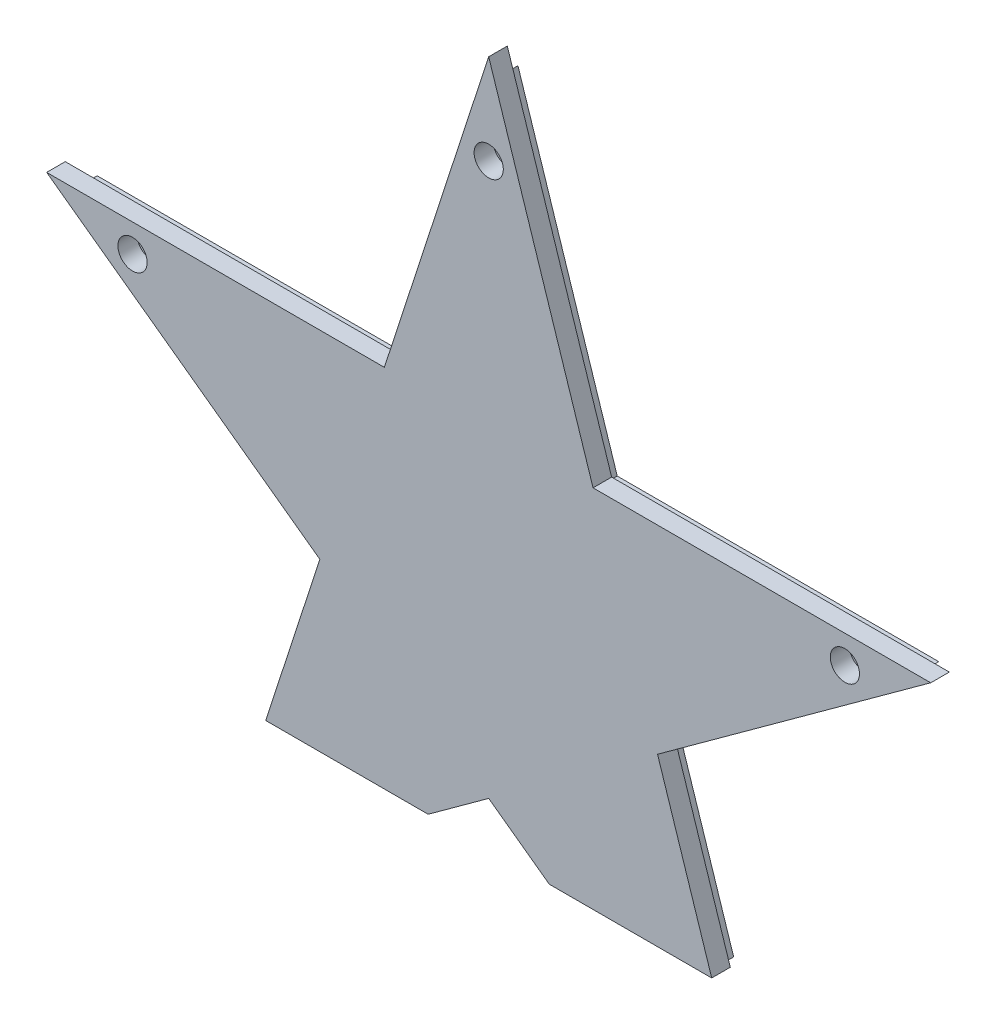
ISO-10303-21;
HEADER;
FILE_DESCRIPTION(('STEP AP214'),'2;1');
FILE_NAME('part.step','',(''),(''),'','','');
FILE_SCHEMA(('AUTOMOTIVE_DESIGN { 1 0 10303 214 1 1 1 1 }'));
ENDSEC;
DATA;
#1=APPLICATION_CONTEXT('core data for automotive mechanical design processes');
#2=APPLICATION_PROTOCOL_DEFINITION('international standard','automotive_design',2000,#1);
#3=PRODUCT_CONTEXT('',#1,'mechanical');
#4=PRODUCT('Part','Part','',(#3));
#5=PRODUCT_RELATED_PRODUCT_CATEGORY('part','',(#4));
#6=PRODUCT_DEFINITION_FORMATION('','',#4);
#7=PRODUCT_DEFINITION_CONTEXT('part definition',#1,'design');
#8=PRODUCT_DEFINITION('design','',#6,#7);
#9=PRODUCT_DEFINITION_SHAPE('','',#8);
#10=(LENGTH_UNIT() NAMED_UNIT(*) SI_UNIT(.MILLI.,.METRE.));
#11=(NAMED_UNIT(*) PLANE_ANGLE_UNIT() SI_UNIT($,.RADIAN.));
#12=(NAMED_UNIT(*) SI_UNIT($,.STERADIAN.) SOLID_ANGLE_UNIT());
#13=UNCERTAINTY_MEASURE_WITH_UNIT(LENGTH_MEASURE(1.E-05),#10,'distance_accuracy_value','');
#14=(GEOMETRIC_REPRESENTATION_CONTEXT(3) GLOBAL_UNCERTAINTY_ASSIGNED_CONTEXT((#13)) GLOBAL_UNIT_ASSIGNED_CONTEXT((#10,
#11,#12)) REPRESENTATION_CONTEXT('',''));
#15=CARTESIAN_POINT('',(0.,0.,0.));
#16=DIRECTION('',(0.,0.,1.));
#17=DIRECTION('',(1.,0.,0.));
#18=AXIS2_PLACEMENT_3D('',#15,#16,#17);
#19=CARTESIAN_POINT('',(-67.0494843988083,21.7856981034338,-4.5));
#20=DIRECTION('',(0.,0.,1.));
#21=DIRECTION('',(1.,0.,0.));
#22=AXIS2_PLACEMENT_3D('',#19,#20,#21);
#23=CYLINDRICAL_SURFACE('',#22,1.85);
#24=CARTESIAN_POINT('',(-67.0494843988083,21.7856981034338,0.));
#25=DIRECTION('',(0.,0.,1.));
#26=DIRECTION('',(1.,0.,0.));
#27=AXIS2_PLACEMENT_3D('',#24,#25,#26);
#28=CIRCLE('',#27,1.85);
#29=CARTESIAN_POINT('',(-65.1994843988083,21.7856981034338,0.));
#30=VERTEX_POINT('',#29);
#31=EDGE_CURVE('E226',#30,#30,#28,.T.);
#32=ORIENTED_EDGE('',*,*,#31,.F.);
#33=EDGE_LOOP('',(#32));
#34=FACE_BOUND('',#33,.T.);
#35=CARTESIAN_POINT('',(-67.0494843988083,21.7856981034338,1.9));
#36=DIRECTION('',(0.,0.,1.));
#37=DIRECTION('',(1.,0.,0.));
#38=AXIS2_PLACEMENT_3D('',#35,#36,#37);
#39=CIRCLE('',#38,1.85);
#40=CARTESIAN_POINT('',(-65.1994843988083,21.7856981034338,1.9));
#41=VERTEX_POINT('',#40);
#42=EDGE_CURVE('E41',#41,#41,#39,.F.);
#43=ORIENTED_EDGE('',*,*,#42,.F.);
#44=EDGE_LOOP('',(#43));
#45=FACE_BOUND('',#44,.T.);
#46=ADVANCED_FACE('F37',(#34,#45),#23,.F.);
#47=CARTESIAN_POINT('',(67.0494843988083,21.7856981034338,-4.5));
#48=DIRECTION('',(0.,0.,1.));
#49=DIRECTION('',(1.,0.,0.));
#50=AXIS2_PLACEMENT_3D('',#47,#48,#49);
#51=CYLINDRICAL_SURFACE('',#50,1.85);
#52=CARTESIAN_POINT('',(67.0494843988083,21.7856981034338,0.));
#53=DIRECTION('',(0.,0.,1.));
#54=DIRECTION('',(1.,0.,0.));
#55=AXIS2_PLACEMENT_3D('',#52,#53,#54);
#56=CIRCLE('',#55,1.85);
#57=CARTESIAN_POINT('',(68.8994843988083,21.7856981034338,0.));
#58=VERTEX_POINT('',#57);
#59=EDGE_CURVE('E230',#58,#58,#56,.T.);
#60=ORIENTED_EDGE('',*,*,#59,.F.);
#61=EDGE_LOOP('',(#60));
#62=FACE_BOUND('',#61,.T.);
#63=CARTESIAN_POINT('',(67.0494843988083,21.7856981034338,1.9));
#64=DIRECTION('',(0.,0.,1.));
#65=DIRECTION('',(1.,0.,0.));
#66=AXIS2_PLACEMENT_3D('',#63,#64,#65);
#67=CIRCLE('',#66,1.85);
#68=CARTESIAN_POINT('',(68.8994843988083,21.7856981034338,1.9));
#69=VERTEX_POINT('',#68);
#70=EDGE_CURVE('E220',#69,#69,#67,.F.);
#71=ORIENTED_EDGE('',*,*,#70,.F.);
#72=EDGE_LOOP('',(#71));
#73=FACE_BOUND('',#72,.T.);
#74=ADVANCED_FACE('F472',(#62,#73),#51,.F.);
#75=CARTESIAN_POINT('',(0.,70.5,-4.5));
#76=DIRECTION('',(0.,0.,1.));
#77=DIRECTION('',(1.,0.,0.));
#78=AXIS2_PLACEMENT_3D('',#75,#76,#77);
#79=CYLINDRICAL_SURFACE('',#78,1.85);
#80=CARTESIAN_POINT('',(0.,70.5,0.));
#81=DIRECTION('',(0.,0.,1.));
#82=DIRECTION('',(1.,0.,0.));
#83=AXIS2_PLACEMENT_3D('',#80,#81,#82);
#84=CIRCLE('',#83,1.85);
#85=CARTESIAN_POINT('',(1.85,70.5,0.));
#86=VERTEX_POINT('',#85);
#87=EDGE_CURVE('E235',#86,#86,#84,.T.);
#88=ORIENTED_EDGE('',*,*,#87,.F.);
#89=EDGE_LOOP('',(#88));
#90=FACE_BOUND('',#89,.T.);
#91=CARTESIAN_POINT('',(0.,70.5,1.9));
#92=DIRECTION('',(0.,0.,1.));
#93=DIRECTION('',(1.,0.,0.));
#94=AXIS2_PLACEMENT_3D('',#91,#92,#93);
#95=CIRCLE('',#94,1.85);
#96=CARTESIAN_POINT('',(1.85,70.5,1.9));
#97=VERTEX_POINT('',#96);
#98=EDGE_CURVE('E218',#97,#97,#95,.F.);
#99=ORIENTED_EDGE('',*,*,#98,.F.);
#100=EDGE_LOOP('',(#99));
#101=FACE_BOUND('',#100,.T.);
#102=ADVANCED_FACE('F478',(#90,#101),#79,.F.);
#103=CARTESIAN_POINT('',(30.2579939442741,-9.83141820099068,2.));
#104=DIRECTION('',(-0.587785252292473,0.809016994374948,0.));
#105=DIRECTION('',(-0.809016994374948,-0.587785252292473,0.));
#106=AXIS2_PLACEMENT_3D('',#103,#104,#105);
#107=PLANE('',#106);
#108=DIRECTION('',(0.809016994374948,0.587785252292473,0.));
#109=VECTOR('',#108,1.);
#110=CARTESIAN_POINT('',(30.2579939442741,-9.83141820099068,0.));
#111=LINE('',#110,#109);
#112=CARTESIAN_POINT('',(30.2579939442741,-9.83141820099068,0.));
#113=VERTEX_POINT('',#112);
#114=CARTESIAN_POINT('',(79.2164565774981,25.7389870078079,0.));
#115=VERTEX_POINT('',#114);
#116=EDGE_CURVE('E173',#113,#115,#111,.T.);
#117=ORIENTED_EDGE('',*,*,#116,.T.);
#118=DIRECTION('',(0.,0.,-1.));
#119=VECTOR('',#118,1.);
#120=CARTESIAN_POINT('',(79.2164565774981,25.7389870078079,2.));
#121=LINE('',#120,#119);
#122=CARTESIAN_POINT('',(79.2164565774981,25.7389870078079,2.));
#123=VERTEX_POINT('',#122);
#124=EDGE_CURVE('E11',#123,#115,#121,.T.);
#125=ORIENTED_EDGE('',*,*,#124,.F.);
#126=DIRECTION('',(0.809016994374948,0.587785252292473,0.));
#127=VECTOR('',#126,1.);
#128=CARTESIAN_POINT('',(30.2579939442741,-9.83141820099068,2.));
#129=LINE('',#128,#127);
#130=CARTESIAN_POINT('',(30.2579939442741,-9.83141820099068,2.));
#131=VERTEX_POINT('',#130);
#132=EDGE_CURVE('E196',#131,#123,#129,.T.);
#133=ORIENTED_EDGE('',*,*,#132,.F.);
#134=DIRECTION('',(0.,0.,-1.));
#135=VECTOR('',#134,1.);
#136=CARTESIAN_POINT('',(30.2579939442741,-9.83141820099068,2.));
#137=LINE('',#136,#135);
#138=EDGE_CURVE('E172',#131,#113,#137,.T.);
#139=ORIENTED_EDGE('',*,*,#138,.T.);
#140=EDGE_LOOP('',(#117,#125,#133,#139));
#141=FACE_BOUND('',#140,.T.);
#142=ADVANCED_FACE('F39',(#141),#107,.F.);
#143=CARTESIAN_POINT('',(79.2164565774981,25.7389870078079,2.));
#144=DIRECTION('',(0.,-1.,0.));
#145=DIRECTION('',(0.,0.,-1.));
#146=AXIS2_PLACEMENT_3D('',#143,#144,#145);
#147=PLANE('',#146);
#148=DIRECTION('',(-1.,0.,0.));
#149=VECTOR('',#148,1.);
#150=CARTESIAN_POINT('',(79.2164565774981,25.7389870078079,0.));
#151=LINE('',#150,#149);
#152=CARTESIAN_POINT('',(18.70046868895,25.7389870078079,0.));
#153=VERTEX_POINT('',#152);
#154=EDGE_CURVE('E176',#115,#153,#151,.T.);
#155=ORIENTED_EDGE('',*,*,#154,.T.);
#156=DIRECTION('',(0.,0.,-1.));
#157=VECTOR('',#156,1.);
#158=CARTESIAN_POINT('',(18.70046868895,25.7389870078079,2.));
#159=LINE('',#158,#157);
#160=CARTESIAN_POINT('',(18.70046868895,25.7389870078079,2.));
#161=VERTEX_POINT('',#160);
#162=EDGE_CURVE('E47',#161,#153,#159,.T.);
#163=ORIENTED_EDGE('',*,*,#162,.F.);
#164=DIRECTION('',(-1.,0.,0.));
#165=VECTOR('',#164,1.);
#166=CARTESIAN_POINT('',(79.2164565774981,25.7389870078079,2.));
#167=LINE('',#166,#165);
#168=EDGE_CURVE('E110',#123,#161,#167,.T.);
#169=ORIENTED_EDGE('',*,*,#168,.F.);
#170=ORIENTED_EDGE('',*,*,#124,.T.);
#171=EDGE_LOOP('',(#155,#163,#169,#170));
#172=FACE_BOUND('',#171,.T.);
#173=ADVANCED_FACE('F521',(#172),#147,.F.);
#174=CARTESIAN_POINT('',(18.70046868895,25.7389870078079,2.));
#175=DIRECTION('',(-0.951056516295153,-0.309016994374949,0.));
#176=DIRECTION('',(0.309016994374949,-0.951056516295153,0.));
#177=AXIS2_PLACEMENT_3D('',#174,#175,#176);
#178=PLANE('',#177);
#179=DIRECTION('',(-0.309016994374949,0.951056516295153,0.));
#180=VECTOR('',#179,1.);
#181=CARTESIAN_POINT('',(18.70046868895,25.7389870078079,0.));
#182=LINE('',#181,#180);
#183=CARTESIAN_POINT('',(0.,83.2931116292503,0.));
#184=VERTEX_POINT('',#183);
#185=EDGE_CURVE('E179',#153,#184,#182,.T.);
#186=ORIENTED_EDGE('',*,*,#185,.T.);
#187=DIRECTION('',(0.,0.,-1.));
#188=VECTOR('',#187,1.);
#189=CARTESIAN_POINT('',(0.,83.2931116292503,2.));
#190=LINE('',#189,#188);
#191=CARTESIAN_POINT('',(0.,83.2931116292503,2.));
#192=VERTEX_POINT('',#191);
#193=EDGE_CURVE('E213',#192,#184,#190,.T.);
#194=ORIENTED_EDGE('',*,*,#193,.F.);
#195=DIRECTION('',(-0.309016994374949,0.951056516295153,0.));
#196=VECTOR('',#195,1.);
#197=CARTESIAN_POINT('',(18.70046868895,25.7389870078079,2.));
#198=LINE('',#197,#196);
#199=EDGE_CURVE('E353',#161,#192,#198,.T.);
#200=ORIENTED_EDGE('',*,*,#199,.F.);
#201=ORIENTED_EDGE('',*,*,#162,.T.);
#202=EDGE_LOOP('',(#186,#194,#200,#201));
#203=FACE_BOUND('',#202,.T.);
#204=ADVANCED_FACE('F518',(#203),#178,.F.);
#205=CARTESIAN_POINT('',(0.,83.2931116292503,2.));
#206=DIRECTION('',(0.951056516295154,-0.309016994374947,0.));
#207=DIRECTION('',(0.309016994374947,0.951056516295154,0.));
#208=AXIS2_PLACEMENT_3D('',#205,#206,#207);
#209=PLANE('',#208);
#210=DIRECTION('',(-0.309016994374947,-0.951056516295154,0.));
#211=VECTOR('',#210,1.);
#212=CARTESIAN_POINT('',(0.,83.2931116292503,0.));
#213=LINE('',#212,#211);
#214=CARTESIAN_POINT('',(-18.7004686889499,25.7389870078079,0.));
#215=VERTEX_POINT('',#214);
#216=EDGE_CURVE('E181',#184,#215,#213,.T.);
#217=ORIENTED_EDGE('',*,*,#216,.T.);
#218=DIRECTION('',(0.,0.,-1.));
#219=VECTOR('',#218,1.);
#220=CARTESIAN_POINT('',(-18.7004686889499,25.7389870078079,2.));
#221=LINE('',#220,#219);
#222=CARTESIAN_POINT('',(-18.7004686889499,25.7389870078079,2.));
#223=VERTEX_POINT('',#222);
#224=EDGE_CURVE('E210',#223,#215,#221,.T.);
#225=ORIENTED_EDGE('',*,*,#224,.F.);
#226=DIRECTION('',(-0.309016994374947,-0.951056516295154,0.));
#227=VECTOR('',#226,1.);
#228=CARTESIAN_POINT('',(0.,83.2931116292503,2.));
#229=LINE('',#228,#227);
#230=EDGE_CURVE('E356',#192,#223,#229,.T.);
#231=ORIENTED_EDGE('',*,*,#230,.F.);
#232=ORIENTED_EDGE('',*,*,#193,.T.);
#233=EDGE_LOOP('',(#217,#225,#231,#232));
#234=FACE_BOUND('',#233,.T.);
#235=ADVANCED_FACE('F514',(#234),#209,.F.);
#236=CARTESIAN_POINT('',(-18.7004686889499,25.7389870078079,2.));
#237=DIRECTION('',(0.,-1.,0.));
#238=DIRECTION('',(0.,0.,-1.));
#239=AXIS2_PLACEMENT_3D('',#236,#237,#238);
#240=PLANE('',#239);
#241=DIRECTION('',(-1.,0.,0.));
#242=VECTOR('',#241,1.);
#243=CARTESIAN_POINT('',(-18.7004686889499,25.7389870078079,0.));
#244=LINE('',#243,#242);
#245=CARTESIAN_POINT('',(-79.2164565774982,25.7389870078079,0.));
#246=VERTEX_POINT('',#245);
#247=EDGE_CURVE('E183',#215,#246,#244,.T.);
#248=ORIENTED_EDGE('',*,*,#247,.T.);
#249=DIRECTION('',(0.,0.,-1.));
#250=VECTOR('',#249,1.);
#251=CARTESIAN_POINT('',(-79.2164565774982,25.7389870078079,2.));
#252=LINE('',#251,#250);
#253=CARTESIAN_POINT('',(-79.2164565774982,25.7389870078079,2.));
#254=VERTEX_POINT('',#253);
#255=EDGE_CURVE('E207',#254,#246,#252,.T.);
#256=ORIENTED_EDGE('',*,*,#255,.F.);
#257=DIRECTION('',(-1.,0.,0.));
#258=VECTOR('',#257,1.);
#259=CARTESIAN_POINT('',(-18.7004686889499,25.7389870078079,2.));
#260=LINE('',#259,#258);
#261=EDGE_CURVE('E359',#223,#254,#260,.T.);
#262=ORIENTED_EDGE('',*,*,#261,.F.);
#263=ORIENTED_EDGE('',*,*,#224,.T.);
#264=EDGE_LOOP('',(#248,#256,#262,#263));
#265=FACE_BOUND('',#264,.T.);
#266=ADVANCED_FACE('F511',(#265),#240,.F.);
#267=CARTESIAN_POINT('',(-79.2164565774982,25.7389870078079,2.));
#268=DIRECTION('',(0.587785252292473,0.809016994374948,0.));
#269=DIRECTION('',(-0.809016994374948,0.587785252292473,0.));
#270=AXIS2_PLACEMENT_3D('',#267,#268,#269);
#271=PLANE('',#270);
#272=DIRECTION('',(0.809016994374948,-0.587785252292473,0.));
#273=VECTOR('',#272,1.);
#274=CARTESIAN_POINT('',(-79.2164565774982,25.7389870078079,0.));
#275=LINE('',#274,#273);
#276=CARTESIAN_POINT('',(-30.2579939442741,-9.83141820099067,0.));
#277=VERTEX_POINT('',#276);
#278=EDGE_CURVE('E185',#246,#277,#275,.T.);
#279=ORIENTED_EDGE('',*,*,#278,.T.);
#280=DIRECTION('',(0.,0.,-1.));
#281=VECTOR('',#280,1.);
#282=CARTESIAN_POINT('',(-30.2579939442741,-9.83141820099067,2.));
#283=LINE('',#282,#281);
#284=CARTESIAN_POINT('',(-30.2579939442741,-9.83141820099067,2.));
#285=VERTEX_POINT('',#284);
#286=EDGE_CURVE('E204',#285,#277,#283,.T.);
#287=ORIENTED_EDGE('',*,*,#286,.F.);
#288=DIRECTION('',(0.809016994374948,-0.587785252292473,0.));
#289=VECTOR('',#288,1.);
#290=CARTESIAN_POINT('',(-79.2164565774982,25.7389870078079,2.));
#291=LINE('',#290,#289);
#292=EDGE_CURVE('E166',#254,#285,#291,.T.);
#293=ORIENTED_EDGE('',*,*,#292,.F.);
#294=ORIENTED_EDGE('',*,*,#255,.T.);
#295=EDGE_LOOP('',(#279,#287,#293,#294));
#296=FACE_BOUND('',#295,.T.);
#297=ADVANCED_FACE('F369',(#296),#271,.F.);
#298=CARTESIAN_POINT('',(-30.2579939442741,-9.83141820099067,2.));
#299=DIRECTION('',(0.951056516295154,-0.309016994374947,0.));
#300=DIRECTION('',(0.309016994374947,0.951056516295154,0.));
#301=AXIS2_PLACEMENT_3D('',#298,#299,#300);
#302=PLANE('',#301);
#303=DIRECTION('',(-0.309016994374947,-0.951056516295154,0.));
#304=VECTOR('',#303,1.);
#305=CARTESIAN_POINT('',(-30.2579939442741,-9.83141820099067,0.));
#306=LINE('',#305,#304);
#307=CARTESIAN_POINT('',(-40.6150037851004,-41.7070168824639,0.));
#308=VERTEX_POINT('',#307);
#309=EDGE_CURVE('E187',#277,#308,#306,.T.);
#310=ORIENTED_EDGE('',*,*,#309,.T.);
#311=DIRECTION('',(0.,0.,-1.));
#312=VECTOR('',#311,1.);
#313=CARTESIAN_POINT('',(-40.6150037851004,-41.7070168824639,2.));
#314=LINE('',#313,#312);
#315=CARTESIAN_POINT('',(-40.6150037851004,-41.7070168824639,2.));
#316=VERTEX_POINT('',#315);
#317=EDGE_CURVE('E201',#316,#308,#314,.T.);
#318=ORIENTED_EDGE('',*,*,#317,.F.);
#319=DIRECTION('',(-0.309016994374947,-0.951056516295154,0.));
#320=VECTOR('',#319,1.);
#321=CARTESIAN_POINT('',(-30.2579939442741,-9.83141820099067,2.));
#322=LINE('',#321,#320);
#323=EDGE_CURVE('E163',#285,#316,#322,.T.);
#324=ORIENTED_EDGE('',*,*,#323,.F.);
#325=ORIENTED_EDGE('',*,*,#286,.T.);
#326=EDGE_LOOP('',(#310,#318,#324,#325));
#327=FACE_BOUND('',#326,.T.);
#328=ADVANCED_FACE('F373',(#327),#302,.F.);
#329=CARTESIAN_POINT('',(-40.6150037851004,-41.7070168824639,2.));
#330=DIRECTION('',(0.,1.,0.));
#331=DIRECTION('',(-1.,0.,0.));
#332=AXIS2_PLACEMENT_3D('',#329,#330,#331);
#333=PLANE('',#332);
#334=DIRECTION('',(1.,0.,0.));
#335=VECTOR('',#334,1.);
#336=CARTESIAN_POINT('',(-40.6150037851004,-41.7070168824639,0.));
#337=LINE('',#336,#335);
#338=CARTESIAN_POINT('',(-13.6150037851004,-41.7070168824639,0.));
#339=VERTEX_POINT('',#338);
#340=EDGE_CURVE('E189',#308,#339,#337,.T.);
#341=ORIENTED_EDGE('',*,*,#340,.T.);
#342=DIRECTION('',(0.,0.,-1.));
#343=VECTOR('',#342,1.);
#344=CARTESIAN_POINT('',(-13.6150037851004,-41.7070168824639,2.));
#345=LINE('',#344,#343);
#346=CARTESIAN_POINT('',(-13.6150037851004,-41.7070168824639,2.));
#347=VERTEX_POINT('',#346);
#348=EDGE_CURVE('E148',#347,#339,#345,.T.);
#349=ORIENTED_EDGE('',*,*,#348,.F.);
#350=DIRECTION('',(1.,0.,0.));
#351=VECTOR('',#350,1.);
#352=CARTESIAN_POINT('',(-41.9819046766102,-41.7070168824639,2.));
#353=LINE('',#352,#351);
#354=CARTESIAN_POINT('',(-11.4033116833851,-41.7070168824639,2.));
#355=VERTEX_POINT('',#354);
#356=EDGE_CURVE('E162',#347,#355,#353,.T.);
#357=ORIENTED_EDGE('',*,*,#356,.T.);
#358=DIRECTION('',(0.,0.,-1.));
#359=VECTOR('',#358,1.);
#360=CARTESIAN_POINT('',(-11.4033116833851,-41.7070168824639,5.5));
#361=LINE('',#360,#359);
#362=CARTESIAN_POINT('',(-11.4033116833851,-41.7070168824639,5.5));
#363=VERTEX_POINT('',#362);
#364=EDGE_CURVE('E345',#363,#355,#361,.T.);
#365=ORIENTED_EDGE('',*,*,#364,.F.);
#366=DIRECTION('',(1.,0.,0.));
#367=VECTOR('',#366,1.);
#368=CARTESIAN_POINT('',(-41.9819046766102,-41.7070168824639,5.5));
#369=LINE('',#368,#367);
#370=CARTESIAN_POINT('',(-41.9819046766102,-41.7070168824639,5.5));
#371=VERTEX_POINT('',#370);
#372=EDGE_CURVE('E247',#371,#363,#369,.T.);
#373=ORIENTED_EDGE('',*,*,#372,.F.);
#374=DIRECTION('',(0.,0.,-1.));
#375=VECTOR('',#374,1.);
#376=CARTESIAN_POINT('',(-41.9819046766102,-41.7070168824639,5.5));
#377=LINE('',#376,#375);
#378=CARTESIAN_POINT('',(-41.9819046766102,-41.7070168824639,2.));
#379=VERTEX_POINT('',#378);
#380=EDGE_CURVE('E177',#371,#379,#377,.T.);
#381=ORIENTED_EDGE('',*,*,#380,.T.);
#382=EDGE_CURVE('E284',#379,#316,#353,.T.);
#383=ORIENTED_EDGE('',*,*,#382,.T.);
#384=ORIENTED_EDGE('',*,*,#317,.T.);
#385=EDGE_LOOP('',(#341,#349,#357,#365,#373,#381,#383,#384));
#386=FACE_BOUND('',#385,.T.);
#387=ADVANCED_FACE('F376',(#386),#333,.F.);
#388=CARTESIAN_POINT('',(-13.6150037851004,-41.7070168824639,2.));
#389=DIRECTION('',(-0.587785252292473,0.809016994374947,0.));
#390=DIRECTION('',(-0.809016994374948,-0.587785252292473,0.));
#391=AXIS2_PLACEMENT_3D('',#388,#389,#390);
#392=PLANE('',#391);
#393=DIRECTION('',(0.809016994374947,0.587785252292473,0.));
#394=VECTOR('',#393,1.);
#395=CARTESIAN_POINT('',(-13.6150037851004,-41.7070168824639,0.));
#396=LINE('',#395,#394);
#397=CARTESIAN_POINT('',(0.,-31.8151376136345,0.));
#398=VERTEX_POINT('',#397);
#399=EDGE_CURVE('E145',#339,#398,#396,.T.);
#400=ORIENTED_EDGE('',*,*,#399,.T.);
#401=DIRECTION('',(0.,0.,-1.));
#402=VECTOR('',#401,1.);
#403=CARTESIAN_POINT('',(0.,-31.8151376136345,2.));
#404=LINE('',#403,#402);
#405=CARTESIAN_POINT('',(0.,-31.8151376136345,2.));
#406=VERTEX_POINT('',#405);
#407=EDGE_CURVE('E137',#406,#398,#404,.T.);
#408=ORIENTED_EDGE('',*,*,#407,.F.);
#409=DIRECTION('',(0.809016994374947,0.587785252292473,0.));
#410=VECTOR('',#409,1.);
#411=CARTESIAN_POINT('',(-13.6150037851004,-41.7070168824639,2.));
#412=LINE('',#411,#410);
#413=EDGE_CURVE('E142',#347,#406,#412,.T.);
#414=ORIENTED_EDGE('',*,*,#413,.F.);
#415=ORIENTED_EDGE('',*,*,#348,.T.);
#416=EDGE_LOOP('',(#400,#408,#414,#415));
#417=FACE_BOUND('',#416,.T.);
#418=ADVANCED_FACE('F139',(#417),#392,.F.);
#419=CARTESIAN_POINT('',(0.,-31.8151376136345,2.));
#420=DIRECTION('',(0.587785252292473,0.809016994374947,0.));
#421=DIRECTION('',(-0.809016994374947,0.587785252292473,0.));
#422=AXIS2_PLACEMENT_3D('',#419,#420,#421);
#423=PLANE('',#422);
#424=DIRECTION('',(0.809016994374947,-0.587785252292473,0.));
#425=VECTOR('',#424,1.);
#426=CARTESIAN_POINT('',(0.,-31.8151376136345,0.));
#427=LINE('',#426,#425);
#428=CARTESIAN_POINT('',(13.6150037851004,-41.7070168824639,0.));
#429=VERTEX_POINT('',#428);
#430=EDGE_CURVE('E192',#398,#429,#427,.T.);
#431=ORIENTED_EDGE('',*,*,#430,.T.);
#432=DIRECTION('',(0.,0.,-1.));
#433=VECTOR('',#432,1.);
#434=CARTESIAN_POINT('',(13.6150037851004,-41.7070168824639,2.));
#435=LINE('',#434,#433);
#436=CARTESIAN_POINT('',(13.6150037851004,-41.7070168824639,2.));
#437=VERTEX_POINT('',#436);
#438=EDGE_CURVE('E149',#437,#429,#435,.T.);
#439=ORIENTED_EDGE('',*,*,#438,.F.);
#440=DIRECTION('',(0.809016994374947,-0.587785252292473,0.));
#441=VECTOR('',#440,1.);
#442=CARTESIAN_POINT('',(0.,-31.8151376136345,2.));
#443=LINE('',#442,#441);
#444=EDGE_CURVE('E152',#406,#437,#443,.T.);
#445=ORIENTED_EDGE('',*,*,#444,.F.);
#446=ORIENTED_EDGE('',*,*,#407,.T.);
#447=EDGE_LOOP('',(#431,#439,#445,#446));
#448=FACE_BOUND('',#447,.T.);
#449=ADVANCED_FACE('F153',(#448),#423,.F.);
#450=CARTESIAN_POINT('',(13.6150037851004,-41.7070168824639,2.));
#451=DIRECTION('',(0.,1.,0.));
#452=DIRECTION('',(0.,0.,1.));
#453=AXIS2_PLACEMENT_3D('',#450,#451,#452);
#454=PLANE('',#453);
#455=DIRECTION('',(1.,0.,0.));
#456=VECTOR('',#455,1.);
#457=CARTESIAN_POINT('',(13.6150037851004,-41.7070168824639,0.));
#458=LINE('',#457,#456);
#459=CARTESIAN_POINT('',(40.6150037851004,-41.7070168824639,0.));
#460=VERTEX_POINT('',#459);
#461=EDGE_CURVE('E96',#429,#460,#458,.T.);
#462=ORIENTED_EDGE('',*,*,#461,.T.);
#463=DIRECTION('',(0.,0.,-1.));
#464=VECTOR('',#463,1.);
#465=CARTESIAN_POINT('',(40.6150037851004,-41.7070168824639,2.));
#466=LINE('',#465,#464);
#467=CARTESIAN_POINT('',(40.6150037851004,-41.7070168824639,2.));
#468=VERTEX_POINT('',#467);
#469=EDGE_CURVE('E56',#468,#460,#466,.T.);
#470=ORIENTED_EDGE('',*,*,#469,.F.);
#471=DIRECTION('',(1.,0.,0.));
#472=VECTOR('',#471,1.);
#473=CARTESIAN_POINT('',(11.4033116833851,-41.7070168824639,2.));
#474=LINE('',#473,#472);
#475=CARTESIAN_POINT('',(41.9819046766102,-41.7070168824639,2.));
#476=VERTEX_POINT('',#475);
#477=EDGE_CURVE('E293',#468,#476,#474,.T.);
#478=ORIENTED_EDGE('',*,*,#477,.T.);
#479=DIRECTION('',(0.,0.,-1.));
#480=VECTOR('',#479,1.);
#481=CARTESIAN_POINT('',(41.9819046766102,-41.7070168824639,5.5));
#482=LINE('',#481,#480);
#483=CARTESIAN_POINT('',(41.9819046766102,-41.7070168824639,5.5));
#484=VERTEX_POINT('',#483);
#485=EDGE_CURVE('E336',#484,#476,#482,.T.);
#486=ORIENTED_EDGE('',*,*,#485,.F.);
#487=DIRECTION('',(1.,0.,0.));
#488=VECTOR('',#487,1.);
#489=CARTESIAN_POINT('',(11.4033116833851,-41.7070168824639,5.5));
#490=LINE('',#489,#488);
#491=CARTESIAN_POINT('',(11.4033116833851,-41.7070168824639,5.5));
#492=VERTEX_POINT('',#491);
#493=EDGE_CURVE('E257',#492,#484,#490,.T.);
#494=ORIENTED_EDGE('',*,*,#493,.F.);
#495=DIRECTION('',(0.,0.,-1.));
#496=VECTOR('',#495,1.);
#497=CARTESIAN_POINT('',(11.4033116833851,-41.7070168824639,5.5));
#498=LINE('',#497,#496);
#499=CARTESIAN_POINT('',(11.4033116833851,-41.7070168824639,2.));
#500=VERTEX_POINT('',#499);
#501=EDGE_CURVE('E339',#492,#500,#498,.T.);
#502=ORIENTED_EDGE('',*,*,#501,.T.);
#503=EDGE_CURVE('E294',#500,#437,#474,.T.);
#504=ORIENTED_EDGE('',*,*,#503,.T.);
#505=ORIENTED_EDGE('',*,*,#438,.T.);
#506=EDGE_LOOP('',(#462,#470,#478,#486,#494,#502,#504,#505));
#507=FACE_BOUND('',#506,.T.);
#508=ADVANCED_FACE('F380',(#507),#454,.F.);
#509=CARTESIAN_POINT('',(40.6150037851004,-41.7070168824639,2.));
#510=DIRECTION('',(-0.951056516295154,-0.309016994374947,0.));
#511=DIRECTION('',(0.309016994374947,-0.951056516295154,0.));
#512=AXIS2_PLACEMENT_3D('',#509,#510,#511);
#513=PLANE('',#512);
#514=DIRECTION('',(-0.309016994374947,0.951056516295154,0.));
#515=VECTOR('',#514,1.);
#516=CARTESIAN_POINT('',(40.6150037851004,-41.7070168824639,0.));
#517=LINE('',#516,#515);
#518=EDGE_CURVE('E102',#460,#113,#517,.T.);
#519=ORIENTED_EDGE('',*,*,#518,.T.);
#520=ORIENTED_EDGE('',*,*,#138,.F.);
#521=DIRECTION('',(-0.309016994374947,0.951056516295154,0.));
#522=VECTOR('',#521,1.);
#523=CARTESIAN_POINT('',(40.6150037851004,-41.7070168824639,2.));
#524=LINE('',#523,#522);
#525=EDGE_CURVE('E157',#468,#131,#524,.T.);
#526=ORIENTED_EDGE('',*,*,#525,.F.);
#527=ORIENTED_EDGE('',*,*,#469,.T.);
#528=EDGE_LOOP('',(#519,#520,#526,#527));
#529=FACE_BOUND('',#528,.T.);
#530=ADVANCED_FACE('F488',(#529),#513,.F.);
#531=CARTESIAN_POINT('',(0.,0.,0.));
#532=DIRECTION('',(0.,0.,1.));
#533=DIRECTION('',(1.,0.,0.));
#534=AXIS2_PLACEMENT_3D('',#531,#532,#533);
#535=PLANE('',#534);
#536=ORIENTED_EDGE('',*,*,#87,.T.);
#537=EDGE_LOOP('',(#536));
#538=FACE_BOUND('',#537,.T.);
#539=ORIENTED_EDGE('',*,*,#59,.T.);
#540=EDGE_LOOP('',(#539));
#541=FACE_BOUND('',#540,.T.);
#542=ORIENTED_EDGE('',*,*,#31,.T.);
#543=EDGE_LOOP('',(#542));
#544=FACE_BOUND('',#543,.T.);
#545=ORIENTED_EDGE('',*,*,#116,.F.);
#546=ORIENTED_EDGE('',*,*,#518,.F.);
#547=ORIENTED_EDGE('',*,*,#461,.F.);
#548=ORIENTED_EDGE('',*,*,#430,.F.);
#549=ORIENTED_EDGE('',*,*,#399,.F.);
#550=ORIENTED_EDGE('',*,*,#340,.F.);
#551=ORIENTED_EDGE('',*,*,#309,.F.);
#552=ORIENTED_EDGE('',*,*,#278,.F.);
#553=ORIENTED_EDGE('',*,*,#247,.F.);
#554=ORIENTED_EDGE('',*,*,#216,.F.);
#555=ORIENTED_EDGE('',*,*,#185,.F.);
#556=ORIENTED_EDGE('',*,*,#154,.F.);
#557=EDGE_LOOP('',(#545,#546,#547,#548,#549,#550,#551,#552,#553,#554,#555,#556));
#558=FACE_BOUND('',#557,.T.);
#559=ADVANCED_FACE('F379',(#538,#541,#544,#558),#535,.F.);
#560=CARTESIAN_POINT('',(0.,0.,2.));
#561=DIRECTION('',(0.,0.,1.));
#562=DIRECTION('',(1.,0.,0.));
#563=AXIS2_PLACEMENT_3D('',#560,#561,#562);
#564=PLANE('',#563);
#565=ORIENTED_EDGE('',*,*,#356,.F.);
#566=ORIENTED_EDGE('',*,*,#413,.T.);
#567=ORIENTED_EDGE('',*,*,#444,.T.);
#568=ORIENTED_EDGE('',*,*,#503,.F.);
#569=DIRECTION('',(0.809016994374947,-0.587785252292473,0.));
#570=VECTOR('',#569,1.);
#571=CARTESIAN_POINT('',(0.,-33.4220259843842,2.));
#572=LINE('',#571,#570);
#573=CARTESIAN_POINT('',(0.,-33.4220259843842,2.));
#574=VERTEX_POINT('',#573);
#575=EDGE_CURVE('E290',#574,#500,#572,.T.);
#576=ORIENTED_EDGE('',*,*,#575,.F.);
#577=DIRECTION('',(0.809016994374947,0.587785252292473,0.));
#578=VECTOR('',#577,1.);
#579=CARTESIAN_POINT('',(-11.4033116833851,-41.7070168824639,2.));
#580=LINE('',#579,#578);
#581=EDGE_CURVE('E287',#355,#574,#580,.T.);
#582=ORIENTED_EDGE('',*,*,#581,.F.);
#583=EDGE_LOOP('',(#565,#566,#567,#568,#576,#582));
#584=FACE_BOUND('',#583,.T.);
#585=ADVANCED_FACE('F159',(#584),#564,.F.);
#586=ORIENTED_EDGE('',*,*,#292,.T.);
#587=ORIENTED_EDGE('',*,*,#323,.T.);
#588=ORIENTED_EDGE('',*,*,#382,.F.);
#589=DIRECTION('',(-0.309016994374947,-0.951056516295154,0.));
#590=VECTOR('',#589,1.);
#591=CARTESIAN_POINT('',(-31.7862356002346,-10.3279740156158,2.));
#592=LINE('',#591,#590);
#593=CARTESIAN_POINT('',(-31.7862356002346,-10.3279740156158,2.));
#594=VERTEX_POINT('',#593);
#595=EDGE_CURVE('E243',#594,#379,#592,.T.);
#596=ORIENTED_EDGE('',*,*,#595,.F.);
#597=DIRECTION('',(0.809016994374948,-0.587785252292473,0.));
#598=VECTOR('',#597,1.);
#599=CARTESIAN_POINT('',(-83.217445175826,27.0389870078079,2.));
#600=LINE('',#599,#598);
#601=CARTESIAN_POINT('',(-83.217445175826,27.0389870078079,2.));
#602=VERTEX_POINT('',#601);
#603=EDGE_CURVE('E248',#602,#594,#600,.T.);
#604=ORIENTED_EDGE('',*,*,#603,.F.);
#605=DIRECTION('',(-1.,0.,0.));
#606=VECTOR('',#605,1.);
#607=CARTESIAN_POINT('',(-19.6449739753569,27.0389870078079,2.));
#608=LINE('',#607,#606);
#609=CARTESIAN_POINT('',(-19.6449739753569,27.0389870078079,2.));
#610=VERTEX_POINT('',#609);
#611=EDGE_CURVE('E311',#610,#602,#608,.T.);
#612=ORIENTED_EDGE('',*,*,#611,.F.);
#613=DIRECTION('',(-0.309016994374947,-0.951056516295154,0.));
#614=VECTOR('',#613,1.);
#615=CARTESIAN_POINT('',(0.,87.5,2.));
#616=LINE('',#615,#614);
#617=CARTESIAN_POINT('',(0.,87.5,2.));
#618=VERTEX_POINT('',#617);
#619=EDGE_CURVE('E308',#618,#610,#616,.T.);
#620=ORIENTED_EDGE('',*,*,#619,.F.);
#621=DIRECTION('',(-0.309016994374949,0.951056516295153,0.));
#622=VECTOR('',#621,1.);
#623=CARTESIAN_POINT('',(19.6449739753569,27.0389870078079,2.));
#624=LINE('',#623,#622);
#625=CARTESIAN_POINT('',(19.6449739753569,27.0389870078079,2.));
#626=VERTEX_POINT('',#625);
#627=EDGE_CURVE('E305',#626,#618,#624,.T.);
#628=ORIENTED_EDGE('',*,*,#627,.F.);
#629=DIRECTION('',(-1.,0.,0.));
#630=VECTOR('',#629,1.);
#631=CARTESIAN_POINT('',(83.217445175826,27.0389870078079,2.));
#632=LINE('',#631,#630);
#633=CARTESIAN_POINT('',(83.217445175826,27.0389870078079,2.));
#634=VERTEX_POINT('',#633);
#635=EDGE_CURVE('E302',#634,#626,#632,.T.);
#636=ORIENTED_EDGE('',*,*,#635,.F.);
#637=DIRECTION('',(0.809016994374948,0.587785252292473,0.));
#638=VECTOR('',#637,1.);
#639=CARTESIAN_POINT('',(31.7862356002346,-10.3279740156158,2.));
#640=LINE('',#639,#638);
#641=CARTESIAN_POINT('',(31.7862356002346,-10.3279740156158,2.));
#642=VERTEX_POINT('',#641);
#643=EDGE_CURVE('E299',#642,#634,#640,.T.);
#644=ORIENTED_EDGE('',*,*,#643,.F.);
#645=DIRECTION('',(-0.309016994374947,0.951056516295154,0.));
#646=VECTOR('',#645,1.);
#647=CARTESIAN_POINT('',(41.9819046766102,-41.7070168824639,2.));
#648=LINE('',#647,#646);
#649=EDGE_CURVE('E296',#476,#642,#648,.T.);
#650=ORIENTED_EDGE('',*,*,#649,.F.);
#651=ORIENTED_EDGE('',*,*,#477,.F.);
#652=ORIENTED_EDGE('',*,*,#525,.T.);
#653=ORIENTED_EDGE('',*,*,#132,.T.);
#654=ORIENTED_EDGE('',*,*,#168,.T.);
#655=ORIENTED_EDGE('',*,*,#199,.T.);
#656=ORIENTED_EDGE('',*,*,#230,.T.);
#657=ORIENTED_EDGE('',*,*,#261,.T.);
#658=EDGE_LOOP('',(#586,#587,#588,#596,#604,#612,#620,#628,#636,#644,#650,#651,#652,#653,#654,
#655,#656,#657));
#659=FACE_BOUND('',#658,.T.);
#660=ADVANCED_FACE('F364',(#659),#564,.F.);
#661=CARTESIAN_POINT('',(-31.7862356002346,-10.3279740156158,5.5));
#662=DIRECTION('',(0.951056516295154,-0.309016994374947,0.));
#663=DIRECTION('',(0.309016994374947,0.951056516295154,0.));
#664=AXIS2_PLACEMENT_3D('',#661,#662,#663);
#665=PLANE('',#664);
#666=ORIENTED_EDGE('',*,*,#595,.T.);
#667=ORIENTED_EDGE('',*,*,#380,.F.);
#668=DIRECTION('',(-0.309016994374947,-0.951056516295154,0.));
#669=VECTOR('',#668,1.);
#670=CARTESIAN_POINT('',(-31.7862356002346,-10.3279740156158,5.5));
#671=LINE('',#670,#669);
#672=CARTESIAN_POINT('',(-31.7862356002346,-10.3279740156158,5.5));
#673=VERTEX_POINT('',#672);
#674=EDGE_CURVE('E244',#673,#371,#671,.T.);
#675=ORIENTED_EDGE('',*,*,#674,.F.);
#676=DIRECTION('',(0.,0.,-1.));
#677=VECTOR('',#676,1.);
#678=CARTESIAN_POINT('',(-31.7862356002346,-10.3279740156158,5.5));
#679=LINE('',#678,#677);
#680=EDGE_CURVE('E281',#673,#594,#679,.T.);
#681=ORIENTED_EDGE('',*,*,#680,.T.);
#682=EDGE_LOOP('',(#666,#667,#675,#681));
#683=FACE_BOUND('',#682,.T.);
#684=ADVANCED_FACE('F448',(#683),#665,.F.);
#685=CARTESIAN_POINT('',(-11.4033116833851,-41.7070168824639,5.5));
#686=DIRECTION('',(-0.587785252292473,0.809016994374947,0.));
#687=DIRECTION('',(-0.809016994374947,-0.587785252292473,0.));
#688=AXIS2_PLACEMENT_3D('',#685,#686,#687);
#689=PLANE('',#688);
#690=ORIENTED_EDGE('',*,*,#581,.T.);
#691=DIRECTION('',(0.,0.,-1.));
#692=VECTOR('',#691,1.);
#693=CARTESIAN_POINT('',(0.,-33.4220259843842,5.5));
#694=LINE('',#693,#692);
#695=CARTESIAN_POINT('',(0.,-33.4220259843842,5.5));
#696=VERTEX_POINT('',#695);
#697=EDGE_CURVE('E342',#696,#574,#694,.T.);
#698=ORIENTED_EDGE('',*,*,#697,.F.);
#699=DIRECTION('',(0.809016994374947,0.587785252292473,0.));
#700=VECTOR('',#699,1.);
#701=CARTESIAN_POINT('',(-11.4033116833851,-41.7070168824639,5.5));
#702=LINE('',#701,#700);
#703=EDGE_CURVE('E251',#363,#696,#702,.T.);
#704=ORIENTED_EDGE('',*,*,#703,.F.);
#705=ORIENTED_EDGE('',*,*,#364,.T.);
#706=EDGE_LOOP('',(#690,#698,#704,#705));
#707=FACE_BOUND('',#706,.T.);
#708=ADVANCED_FACE('F439',(#707),#689,.F.);
#709=CARTESIAN_POINT('',(0.,-33.4220259843842,5.5));
#710=DIRECTION('',(0.587785252292473,0.809016994374947,0.));
#711=DIRECTION('',(-0.809016994374947,0.587785252292473,0.));
#712=AXIS2_PLACEMENT_3D('',#709,#710,#711);
#713=PLANE('',#712);
#714=ORIENTED_EDGE('',*,*,#575,.T.);
#715=ORIENTED_EDGE('',*,*,#501,.F.);
#716=DIRECTION('',(0.809016994374947,-0.587785252292473,0.));
#717=VECTOR('',#716,1.);
#718=CARTESIAN_POINT('',(0.,-33.4220259843842,5.5));
#719=LINE('',#718,#717);
#720=EDGE_CURVE('E254',#696,#492,#719,.T.);
#721=ORIENTED_EDGE('',*,*,#720,.F.);
#722=ORIENTED_EDGE('',*,*,#697,.T.);
#723=EDGE_LOOP('',(#714,#715,#721,#722));
#724=FACE_BOUND('',#723,.T.);
#725=ADVANCED_FACE('F570',(#724),#713,.F.);
#726=CARTESIAN_POINT('',(41.9819046766102,-41.7070168824639,5.5));
#727=DIRECTION('',(-0.951056516295154,-0.309016994374947,0.));
#728=DIRECTION('',(0.309016994374947,-0.951056516295154,0.));
#729=AXIS2_PLACEMENT_3D('',#726,#727,#728);
#730=PLANE('',#729);
#731=ORIENTED_EDGE('',*,*,#649,.T.);
#732=DIRECTION('',(0.,0.,-1.));
#733=VECTOR('',#732,1.);
#734=CARTESIAN_POINT('',(31.7862356002346,-10.3279740156158,5.5));
#735=LINE('',#734,#733);
#736=CARTESIAN_POINT('',(31.7862356002346,-10.3279740156158,5.5));
#737=VERTEX_POINT('',#736);
#738=EDGE_CURVE('E333',#737,#642,#735,.T.);
#739=ORIENTED_EDGE('',*,*,#738,.F.);
#740=DIRECTION('',(-0.309016994374947,0.951056516295154,0.));
#741=VECTOR('',#740,1.);
#742=CARTESIAN_POINT('',(41.9819046766102,-41.7070168824639,5.5));
#743=LINE('',#742,#741);
#744=EDGE_CURVE('E260',#484,#737,#743,.T.);
#745=ORIENTED_EDGE('',*,*,#744,.F.);
#746=ORIENTED_EDGE('',*,*,#485,.T.);
#747=EDGE_LOOP('',(#731,#739,#745,#746));
#748=FACE_BOUND('',#747,.T.);
#749=ADVANCED_FACE('F540',(#748),#730,.F.);
#750=CARTESIAN_POINT('',(31.7862356002346,-10.3279740156158,5.5));
#751=DIRECTION('',(-0.587785252292473,0.809016994374948,0.));
#752=DIRECTION('',(-0.809016994374948,-0.587785252292473,0.));
#753=AXIS2_PLACEMENT_3D('',#750,#751,#752);
#754=PLANE('',#753);
#755=ORIENTED_EDGE('',*,*,#643,.T.);
#756=DIRECTION('',(0.,0.,-1.));
#757=VECTOR('',#756,1.);
#758=CARTESIAN_POINT('',(83.217445175826,27.0389870078079,5.5));
#759=LINE('',#758,#757);
#760=CARTESIAN_POINT('',(83.217445175826,27.0389870078079,5.5));
#761=VERTEX_POINT('',#760);
#762=EDGE_CURVE('E330',#761,#634,#759,.T.);
#763=ORIENTED_EDGE('',*,*,#762,.F.);
#764=DIRECTION('',(0.809016994374948,0.587785252292473,0.));
#765=VECTOR('',#764,1.);
#766=CARTESIAN_POINT('',(31.7862356002346,-10.3279740156158,5.5));
#767=LINE('',#766,#765);
#768=EDGE_CURVE('E263',#737,#761,#767,.T.);
#769=ORIENTED_EDGE('',*,*,#768,.F.);
#770=ORIENTED_EDGE('',*,*,#738,.T.);
#771=EDGE_LOOP('',(#755,#763,#769,#770));
#772=FACE_BOUND('',#771,.T.);
#773=ADVANCED_FACE('F547',(#772),#754,.F.);
#774=CARTESIAN_POINT('',(83.217445175826,27.0389870078079,5.5));
#775=DIRECTION('',(0.,-1.,0.));
#776=DIRECTION('',(1.,0.,0.));
#777=AXIS2_PLACEMENT_3D('',#774,#775,#776);
#778=PLANE('',#777);
#779=ORIENTED_EDGE('',*,*,#635,.T.);
#780=DIRECTION('',(0.,0.,-1.));
#781=VECTOR('',#780,1.);
#782=CARTESIAN_POINT('',(19.6449739753569,27.0389870078079,5.5));
#783=LINE('',#782,#781);
#784=CARTESIAN_POINT('',(19.6449739753569,27.0389870078079,5.5));
#785=VERTEX_POINT('',#784);
#786=EDGE_CURVE('E327',#785,#626,#783,.T.);
#787=ORIENTED_EDGE('',*,*,#786,.F.);
#788=DIRECTION('',(-1.,0.,0.));
#789=VECTOR('',#788,1.);
#790=CARTESIAN_POINT('',(83.217445175826,27.0389870078079,5.5));
#791=LINE('',#790,#789);
#792=EDGE_CURVE('E266',#761,#785,#791,.T.);
#793=ORIENTED_EDGE('',*,*,#792,.F.);
#794=ORIENTED_EDGE('',*,*,#762,.T.);
#795=EDGE_LOOP('',(#779,#787,#793,#794));
#796=FACE_BOUND('',#795,.T.);
#797=ADVANCED_FACE('F550',(#796),#778,.F.);
#798=CARTESIAN_POINT('',(19.6449739753569,27.0389870078079,5.5));
#799=DIRECTION('',(-0.951056516295153,-0.309016994374949,0.));
#800=DIRECTION('',(0.309016994374949,-0.951056516295153,0.));
#801=AXIS2_PLACEMENT_3D('',#798,#799,#800);
#802=PLANE('',#801);
#803=ORIENTED_EDGE('',*,*,#627,.T.);
#804=DIRECTION('',(0.,0.,-1.));
#805=VECTOR('',#804,1.);
#806=CARTESIAN_POINT('',(0.,87.5,5.5));
#807=LINE('',#806,#805);
#808=CARTESIAN_POINT('',(0.,87.5,5.5));
#809=VERTEX_POINT('',#808);
#810=EDGE_CURVE('E324',#809,#618,#807,.T.);
#811=ORIENTED_EDGE('',*,*,#810,.F.);
#812=DIRECTION('',(-0.309016994374949,0.951056516295153,0.));
#813=VECTOR('',#812,1.);
#814=CARTESIAN_POINT('',(19.6449739753569,27.0389870078079,5.5));
#815=LINE('',#814,#813);
#816=EDGE_CURVE('E269',#785,#809,#815,.T.);
#817=ORIENTED_EDGE('',*,*,#816,.F.);
#818=ORIENTED_EDGE('',*,*,#786,.T.);
#819=EDGE_LOOP('',(#803,#811,#817,#818));
#820=FACE_BOUND('',#819,.T.);
#821=ADVANCED_FACE('F554',(#820),#802,.F.);
#822=CARTESIAN_POINT('',(0.,87.5,5.5));
#823=DIRECTION('',(0.951056516295154,-0.309016994374947,0.));
#824=DIRECTION('',(0.309016994374947,0.951056516295154,0.));
#825=AXIS2_PLACEMENT_3D('',#822,#823,#824);
#826=PLANE('',#825);
#827=ORIENTED_EDGE('',*,*,#619,.T.);
#828=DIRECTION('',(0.,0.,-1.));
#829=VECTOR('',#828,1.);
#830=CARTESIAN_POINT('',(-19.6449739753569,27.0389870078079,5.5));
#831=LINE('',#830,#829);
#832=CARTESIAN_POINT('',(-19.6449739753569,27.0389870078079,5.5));
#833=VERTEX_POINT('',#832);
#834=EDGE_CURVE('E321',#833,#610,#831,.T.);
#835=ORIENTED_EDGE('',*,*,#834,.F.);
#836=DIRECTION('',(-0.309016994374947,-0.951056516295154,0.));
#837=VECTOR('',#836,1.);
#838=CARTESIAN_POINT('',(0.,87.5,5.5));
#839=LINE('',#838,#837);
#840=EDGE_CURVE('E272',#809,#833,#839,.T.);
#841=ORIENTED_EDGE('',*,*,#840,.F.);
#842=ORIENTED_EDGE('',*,*,#810,.T.);
#843=EDGE_LOOP('',(#827,#835,#841,#842));
#844=FACE_BOUND('',#843,.T.);
#845=ADVANCED_FACE('F468',(#844),#826,.F.);
#846=CARTESIAN_POINT('',(-19.6449739753569,27.0389870078079,5.5));
#847=DIRECTION('',(0.,-1.,0.));
#848=DIRECTION('',(1.,0.,0.));
#849=AXIS2_PLACEMENT_3D('',#846,#847,#848);
#850=PLANE('',#849);
#851=ORIENTED_EDGE('',*,*,#611,.T.);
#852=DIRECTION('',(0.,0.,-1.));
#853=VECTOR('',#852,1.);
#854=CARTESIAN_POINT('',(-83.217445175826,27.0389870078079,5.5));
#855=LINE('',#854,#853);
#856=CARTESIAN_POINT('',(-83.217445175826,27.0389870078079,5.5));
#857=VERTEX_POINT('',#856);
#858=EDGE_CURVE('E318',#857,#602,#855,.T.);
#859=ORIENTED_EDGE('',*,*,#858,.F.);
#860=DIRECTION('',(-1.,0.,0.));
#861=VECTOR('',#860,1.);
#862=CARTESIAN_POINT('',(-19.6449739753569,27.0389870078079,5.5));
#863=LINE('',#862,#861);
#864=EDGE_CURVE('E275',#833,#857,#863,.T.);
#865=ORIENTED_EDGE('',*,*,#864,.F.);
#866=ORIENTED_EDGE('',*,*,#834,.T.);
#867=EDGE_LOOP('',(#851,#859,#865,#866));
#868=FACE_BOUND('',#867,.T.);
#869=ADVANCED_FACE('F455',(#868),#850,.F.);
#870=CARTESIAN_POINT('',(-83.217445175826,27.0389870078079,5.5));
#871=DIRECTION('',(0.587785252292473,0.809016994374948,0.));
#872=DIRECTION('',(-0.809016994374948,0.587785252292473,0.));
#873=AXIS2_PLACEMENT_3D('',#870,#871,#872);
#874=PLANE('',#873);
#875=ORIENTED_EDGE('',*,*,#603,.T.);
#876=ORIENTED_EDGE('',*,*,#680,.F.);
#877=DIRECTION('',(0.809016994374948,-0.587785252292473,0.));
#878=VECTOR('',#877,1.);
#879=CARTESIAN_POINT('',(-83.217445175826,27.0389870078079,5.5));
#880=LINE('',#879,#878);
#881=EDGE_CURVE('E278',#857,#673,#880,.T.);
#882=ORIENTED_EDGE('',*,*,#881,.F.);
#883=ORIENTED_EDGE('',*,*,#858,.T.);
#884=EDGE_LOOP('',(#875,#876,#882,#883));
#885=FACE_BOUND('',#884,.T.);
#886=ADVANCED_FACE('F458',(#885),#874,.F.);
#887=CARTESIAN_POINT('',(0.,0.,5.5));
#888=DIRECTION('',(0.,0.,1.));
#889=DIRECTION('',(1.,0.,0.));
#890=AXIS2_PLACEMENT_3D('',#887,#888,#889);
#891=PLANE('',#890);
#892=CARTESIAN_POINT('',(67.0494843988083,21.7856981034338,5.5));
#893=DIRECTION('',(0.,0.,1.));
#894=DIRECTION('',(1.,0.,0.));
#895=AXIS2_PLACEMENT_3D('',#892,#893,#894);
#896=CIRCLE('',#895,2.75000000000001);
#897=CARTESIAN_POINT('',(69.7994843988083,21.7856981034338,5.5));
#898=VERTEX_POINT('',#897);
#899=EDGE_CURVE('E813',#898,#898,#896,.T.);
#900=ORIENTED_EDGE('',*,*,#899,.F.);
#901=EDGE_LOOP('',(#900));
#902=FACE_BOUND('',#901,.T.);
#903=CARTESIAN_POINT('',(0.,70.5,5.5));
#904=DIRECTION('',(0.,0.,1.));
#905=DIRECTION('',(1.,0.,0.));
#906=AXIS2_PLACEMENT_3D('',#903,#904,#905);
#907=CIRCLE('',#906,2.75);
#908=CARTESIAN_POINT('',(2.75,70.5,5.5));
#909=VERTEX_POINT('',#908);
#910=EDGE_CURVE('E806',#909,#909,#907,.T.);
#911=ORIENTED_EDGE('',*,*,#910,.F.);
#912=EDGE_LOOP('',(#911));
#913=FACE_BOUND('',#912,.T.);
#914=CARTESIAN_POINT('',(-67.0494843988083,21.7856981034338,5.5));
#915=DIRECTION('',(0.,0.,1.));
#916=DIRECTION('',(1.,0.,0.));
#917=AXIS2_PLACEMENT_3D('',#914,#915,#916);
#918=CIRCLE('',#917,2.75000000000001);
#919=CARTESIAN_POINT('',(-64.2994843988083,21.7856981034338,5.5));
#920=VERTEX_POINT('',#919);
#921=EDGE_CURVE('E238',#920,#920,#918,.T.);
#922=ORIENTED_EDGE('',*,*,#921,.F.);
#923=EDGE_LOOP('',(#922));
#924=FACE_BOUND('',#923,.T.);
#925=ORIENTED_EDGE('',*,*,#674,.T.);
#926=ORIENTED_EDGE('',*,*,#372,.T.);
#927=ORIENTED_EDGE('',*,*,#703,.T.);
#928=ORIENTED_EDGE('',*,*,#720,.T.);
#929=ORIENTED_EDGE('',*,*,#493,.T.);
#930=ORIENTED_EDGE('',*,*,#744,.T.);
#931=ORIENTED_EDGE('',*,*,#768,.T.);
#932=ORIENTED_EDGE('',*,*,#792,.T.);
#933=ORIENTED_EDGE('',*,*,#816,.T.);
#934=ORIENTED_EDGE('',*,*,#840,.T.);
#935=ORIENTED_EDGE('',*,*,#864,.T.);
#936=ORIENTED_EDGE('',*,*,#881,.T.);
#937=EDGE_LOOP('',(#925,#926,#927,#928,#929,#930,#931,#932,#933,#934,#935,#936));
#938=FACE_BOUND('',#937,.T.);
#939=ADVANCED_FACE('F443',(#902,#913,#924,#938),#891,.T.);
#940=CARTESIAN_POINT('',(0.,70.5,1.9));
#941=DIRECTION('',(0.,0.,1.));
#942=DIRECTION('',(1.,0.,0.));
#943=AXIS2_PLACEMENT_3D('',#940,#941,#942);
#944=PLANE('',#943);
#945=CARTESIAN_POINT('',(0.,70.5,1.9));
#946=DIRECTION('',(0.,0.,1.));
#947=DIRECTION('',(1.,0.,0.));
#948=AXIS2_PLACEMENT_3D('',#945,#946,#947);
#949=CIRCLE('',#948,2.75);
#950=CARTESIAN_POINT('',(2.75,70.5,1.9));
#951=VERTEX_POINT('',#950);
#952=EDGE_CURVE('E808',#951,#951,#949,.T.);
#953=ORIENTED_EDGE('',*,*,#952,.T.);
#954=EDGE_LOOP('',(#953));
#955=FACE_BOUND('',#954,.T.);
#956=ORIENTED_EDGE('',*,*,#98,.T.);
#957=EDGE_LOOP('',(#956));
#958=FACE_BOUND('',#957,.T.);
#959=ADVANCED_FACE('F465',(#955,#958),#944,.T.);
#960=CARTESIAN_POINT('',(0.,70.5,1.9));
#961=DIRECTION('',(0.,0.,1.));
#962=DIRECTION('',(1.,0.,0.));
#963=AXIS2_PLACEMENT_3D('',#960,#961,#962);
#964=CYLINDRICAL_SURFACE('',#963,2.75);
#965=ORIENTED_EDGE('',*,*,#952,.F.);
#966=EDGE_LOOP('',(#965));
#967=FACE_BOUND('',#966,.T.);
#968=ORIENTED_EDGE('',*,*,#910,.T.);
#969=EDGE_LOOP('',(#968));
#970=FACE_BOUND('',#969,.T.);
#971=ADVANCED_FACE('F745',(#967,#970),#964,.F.);
#972=CARTESIAN_POINT('',(67.0494843988083,21.7856981034338,1.9));
#973=DIRECTION('',(0.,0.,1.));
#974=DIRECTION('',(1.,0.,0.));
#975=AXIS2_PLACEMENT_3D('',#972,#973,#974);
#976=PLANE('',#975);
#977=CARTESIAN_POINT('',(67.0494843988083,21.7856981034338,1.9));
#978=DIRECTION('',(0.,0.,1.));
#979=DIRECTION('',(1.,0.,0.));
#980=AXIS2_PLACEMENT_3D('',#977,#978,#979);
#981=CIRCLE('',#980,2.75000000000001);
#982=CARTESIAN_POINT('',(69.7994843988083,21.7856981034338,1.9));
#983=VERTEX_POINT('',#982);
#984=EDGE_CURVE('E221',#983,#983,#981,.T.);
#985=ORIENTED_EDGE('',*,*,#984,.T.);
#986=EDGE_LOOP('',(#985));
#987=FACE_BOUND('',#986,.T.);
#988=ORIENTED_EDGE('',*,*,#70,.T.);
#989=EDGE_LOOP('',(#988));
#990=FACE_BOUND('',#989,.T.);
#991=ADVANCED_FACE('F755',(#987,#990),#976,.T.);
#992=CARTESIAN_POINT('',(67.0494843988083,21.7856981034338,1.9));
#993=DIRECTION('',(0.,0.,1.));
#994=DIRECTION('',(1.,0.,0.));
#995=AXIS2_PLACEMENT_3D('',#992,#993,#994);
#996=CYLINDRICAL_SURFACE('',#995,2.75000000000001);
#997=ORIENTED_EDGE('',*,*,#984,.F.);
#998=EDGE_LOOP('',(#997));
#999=FACE_BOUND('',#998,.T.);
#1000=ORIENTED_EDGE('',*,*,#899,.T.);
#1001=EDGE_LOOP('',(#1000));
#1002=FACE_BOUND('',#1001,.T.);
#1003=ADVANCED_FACE('F765',(#999,#1002),#996,.F.);
#1004=CARTESIAN_POINT('',(-67.0494843988083,21.7856981034338,1.9));
#1005=DIRECTION('',(0.,0.,1.));
#1006=DIRECTION('',(1.,0.,0.));
#1007=AXIS2_PLACEMENT_3D('',#1004,#1005,#1006);
#1008=PLANE('',#1007);
#1009=CARTESIAN_POINT('',(-67.0494843988083,21.7856981034338,1.9));
#1010=DIRECTION('',(0.,0.,1.));
#1011=DIRECTION('',(1.,0.,0.));
#1012=AXIS2_PLACEMENT_3D('',#1009,#1010,#1011);
#1013=CIRCLE('',#1012,2.75000000000001);
#1014=CARTESIAN_POINT('',(-64.2994843988083,21.7856981034338,1.9));
#1015=VERTEX_POINT('',#1014);
#1016=EDGE_CURVE('E802',#1015,#1015,#1013,.T.);
#1017=ORIENTED_EDGE('',*,*,#1016,.T.);
#1018=EDGE_LOOP('',(#1017));
#1019=FACE_BOUND('',#1018,.T.);
#1020=ORIENTED_EDGE('',*,*,#42,.T.);
#1021=EDGE_LOOP('',(#1020));
#1022=FACE_BOUND('',#1021,.T.);
#1023=ADVANCED_FACE('F775',(#1019,#1022),#1008,.T.);
#1024=CARTESIAN_POINT('',(-67.0494843988083,21.7856981034338,1.9));
#1025=DIRECTION('',(0.,0.,1.));
#1026=DIRECTION('',(1.,0.,0.));
#1027=AXIS2_PLACEMENT_3D('',#1024,#1025,#1026);
#1028=CYLINDRICAL_SURFACE('',#1027,2.75000000000001);
#1029=ORIENTED_EDGE('',*,*,#1016,.F.);
#1030=EDGE_LOOP('',(#1029));
#1031=FACE_BOUND('',#1030,.T.);
#1032=ORIENTED_EDGE('',*,*,#921,.T.);
#1033=EDGE_LOOP('',(#1032));
#1034=FACE_BOUND('',#1033,.T.);
#1035=ADVANCED_FACE('F785',(#1031,#1034),#1028,.F.);
#1036=CLOSED_SHELL('',(#46,#74,#102,#142,#173,#204,#235,#266,#297,#328,#387,#418,#449,#508,#530,
#559,#585,#660,#684,#708,#725,#749,#773,#797,#821,#845,#869,#886,#939,#959,#971,#991,#1003,
#1023,#1035));
#1037=MANIFOLD_SOLID_BREP('B2',#1036);
#1038=ADVANCED_BREP_SHAPE_REPRESENTATION('',(#18,#1037),#14);
#1039=SHAPE_DEFINITION_REPRESENTATION(#9,#1038);
ENDSEC;
END-ISO-10303-21;
